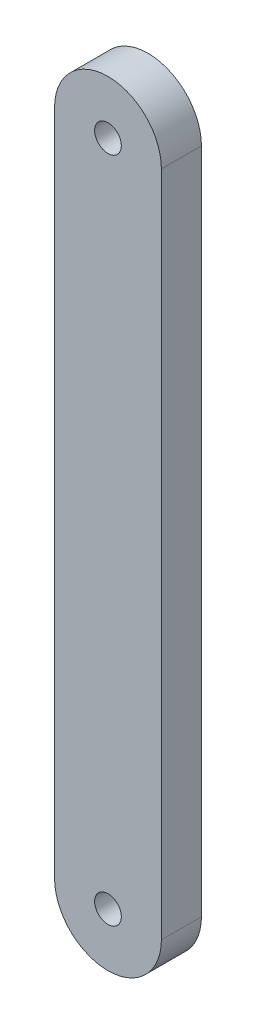
ISO-10303-21;
HEADER;
FILE_DESCRIPTION(('STEP AP214'),'2;1');
FILE_NAME('part.step','',(''),(''),'','','');
FILE_SCHEMA(('AUTOMOTIVE_DESIGN { 1 0 10303 214 1 1 1 1 }'));
ENDSEC;
DATA;
#1=APPLICATION_CONTEXT('core data for automotive mechanical design processes');
#2=APPLICATION_PROTOCOL_DEFINITION('international standard','automotive_design',2000,#1);
#3=PRODUCT_CONTEXT('',#1,'mechanical');
#4=PRODUCT('Part','Part','',(#3));
#5=PRODUCT_RELATED_PRODUCT_CATEGORY('part','',(#4));
#6=PRODUCT_DEFINITION_FORMATION('','',#4);
#7=PRODUCT_DEFINITION_CONTEXT('part definition',#1,'design');
#8=PRODUCT_DEFINITION('design','',#6,#7);
#9=PRODUCT_DEFINITION_SHAPE('','',#8);
#10=(LENGTH_UNIT() NAMED_UNIT(*) SI_UNIT(.MILLI.,.METRE.));
#11=(NAMED_UNIT(*) PLANE_ANGLE_UNIT() SI_UNIT($,.RADIAN.));
#12=(NAMED_UNIT(*) SI_UNIT($,.STERADIAN.) SOLID_ANGLE_UNIT());
#13=UNCERTAINTY_MEASURE_WITH_UNIT(LENGTH_MEASURE(1.E-05),#10,'distance_accuracy_value','');
#14=(GEOMETRIC_REPRESENTATION_CONTEXT(3) GLOBAL_UNCERTAINTY_ASSIGNED_CONTEXT((#13)) GLOBAL_UNIT_ASSIGNED_CONTEXT((#10,
#11,#12)) REPRESENTATION_CONTEXT('',''));
#15=CARTESIAN_POINT('',(0.,0.,0.));
#16=DIRECTION('',(0.,0.,1.));
#17=DIRECTION('',(1.,0.,0.));
#18=AXIS2_PLACEMENT_3D('',#15,#16,#17);
#19=CARTESIAN_POINT('',(38.7468759711318,62.5456089066798,3.));
#20=DIRECTION('',(0.,0.,1.));
#21=DIRECTION('',(1.,0.,0.));
#22=AXIS2_PLACEMENT_3D('',#19,#20,#21);
#23=PLANE('',#22);
#24=CARTESIAN_POINT('',(38.7468759711318,12.5456089066798,3.));
#25=DIRECTION('',(0.,0.,1.));
#26=DIRECTION('',(1.,0.,0.));
#27=AXIS2_PLACEMENT_3D('',#24,#25,#26);
#28=CIRCLE('',#27,1.);
#29=CARTESIAN_POINT('',(39.7468759711318,12.5456089066798,3.));
#30=VERTEX_POINT('',#29);
#31=EDGE_CURVE('E141',#30,#30,#28,.T.);
#32=ORIENTED_EDGE('',*,*,#31,.F.);
#33=EDGE_LOOP('',(#32));
#34=FACE_BOUND('',#33,.T.);
#35=CARTESIAN_POINT('',(38.7468759711318,62.5456089066798,3.));
#36=DIRECTION('',(0.,0.,1.));
#37=DIRECTION('',(1.,0.,0.));
#38=AXIS2_PLACEMENT_3D('',#35,#36,#37);
#39=CIRCLE('',#38,4.);
#40=CARTESIAN_POINT('',(42.7468759711318,62.5456089066798,3.));
#41=VERTEX_POINT('',#40);
#42=CARTESIAN_POINT('',(34.7468759711318,62.5456089066798,3.));
#43=VERTEX_POINT('',#42);
#44=EDGE_CURVE('E120',#41,#43,#39,.T.);
#45=ORIENTED_EDGE('',*,*,#44,.T.);
#46=DIRECTION('',(0.,-1.,0.));
#47=VECTOR('',#46,1.);
#48=CARTESIAN_POINT('',(34.7468759711318,62.5456089066798,3.));
#49=LINE('',#48,#47);
#50=CARTESIAN_POINT('',(34.7468759711318,12.5456089066798,3.));
#51=VERTEX_POINT('',#50);
#52=EDGE_CURVE('E113',#43,#51,#49,.T.);
#53=ORIENTED_EDGE('',*,*,#52,.T.);
#54=CARTESIAN_POINT('',(38.7468759711318,12.5456089066798,3.));
#55=DIRECTION('',(0.,0.,1.));
#56=DIRECTION('',(1.,0.,0.));
#57=AXIS2_PLACEMENT_3D('',#54,#55,#56);
#58=CIRCLE('',#57,4.);
#59=CARTESIAN_POINT('',(42.7468759711318,12.5456089066798,3.));
#60=VERTEX_POINT('',#59);
#61=EDGE_CURVE('E119',#51,#60,#58,.T.);
#62=ORIENTED_EDGE('',*,*,#61,.T.);
#63=DIRECTION('',(0.,-1.,0.));
#64=VECTOR('',#63,1.);
#65=CARTESIAN_POINT('',(42.7468759711318,62.5456089066798,3.));
#66=LINE('',#65,#64);
#67=EDGE_CURVE('E132',#41,#60,#66,.T.);
#68=ORIENTED_EDGE('',*,*,#67,.F.);
#69=EDGE_LOOP('',(#45,#53,#62,#68));
#70=FACE_BOUND('',#69,.T.);
#71=CARTESIAN_POINT('',(38.7468759711318,62.5456089066798,3.));
#72=DIRECTION('',(0.,0.,1.));
#73=DIRECTION('',(1.,0.,0.));
#74=AXIS2_PLACEMENT_3D('',#71,#72,#73);
#75=CIRCLE('',#74,1.);
#76=CARTESIAN_POINT('',(39.7468759711318,62.5456089066798,3.));
#77=VERTEX_POINT('',#76);
#78=EDGE_CURVE('E161',#77,#77,#75,.T.);
#79=ORIENTED_EDGE('',*,*,#78,.F.);
#80=EDGE_LOOP('',(#79));
#81=FACE_BOUND('',#80,.T.);
#82=ADVANCED_FACE('F69',(#34,#70,#81),#23,.T.);
#83=CARTESIAN_POINT('',(38.7468759711318,62.5456089066798,0.));
#84=DIRECTION('',(0.,0.,1.));
#85=DIRECTION('',(1.,0.,0.));
#86=AXIS2_PLACEMENT_3D('',#83,#84,#85);
#87=PLANE('',#86);
#88=CARTESIAN_POINT('',(38.7468759711318,62.5456089066798,0.));
#89=DIRECTION('',(0.,0.,1.));
#90=DIRECTION('',(1.,0.,0.));
#91=AXIS2_PLACEMENT_3D('',#88,#89,#90);
#92=CIRCLE('',#91,4.);
#93=CARTESIAN_POINT('',(42.7468759711318,62.5456089066798,0.));
#94=VERTEX_POINT('',#93);
#95=CARTESIAN_POINT('',(34.7468759711318,62.5456089066798,0.));
#96=VERTEX_POINT('',#95);
#97=EDGE_CURVE('E138',#94,#96,#92,.T.);
#98=ORIENTED_EDGE('',*,*,#97,.F.);
#99=DIRECTION('',(0.,-1.,0.));
#100=VECTOR('',#99,1.);
#101=CARTESIAN_POINT('',(42.7468759711318,62.5456089066798,0.));
#102=LINE('',#101,#100);
#103=CARTESIAN_POINT('',(42.7468759711318,12.5456089066798,0.));
#104=VERTEX_POINT('',#103);
#105=EDGE_CURVE('E147',#94,#104,#102,.T.);
#106=ORIENTED_EDGE('',*,*,#105,.T.);
#107=CARTESIAN_POINT('',(38.7468759711318,12.5456089066798,0.));
#108=DIRECTION('',(0.,0.,1.));
#109=DIRECTION('',(1.,0.,0.));
#110=AXIS2_PLACEMENT_3D('',#107,#108,#109);
#111=CIRCLE('',#110,4.);
#112=CARTESIAN_POINT('',(34.7468759711318,12.5456089066798,0.));
#113=VERTEX_POINT('',#112);
#114=EDGE_CURVE('E144',#113,#104,#111,.T.);
#115=ORIENTED_EDGE('',*,*,#114,.F.);
#116=DIRECTION('',(0.,-1.,0.));
#117=VECTOR('',#116,1.);
#118=CARTESIAN_POINT('',(34.7468759711318,62.5456089066798,0.));
#119=LINE('',#118,#117);
#120=EDGE_CURVE('E126',#96,#113,#119,.T.);
#121=ORIENTED_EDGE('',*,*,#120,.F.);
#122=EDGE_LOOP('',(#98,#106,#115,#121));
#123=FACE_BOUND('',#122,.T.);
#124=CARTESIAN_POINT('',(38.7468759711318,12.5456089066798,0.));
#125=DIRECTION('',(0.,0.,1.));
#126=DIRECTION('',(1.,0.,0.));
#127=AXIS2_PLACEMENT_3D('',#124,#125,#126);
#128=CIRCLE('',#127,1.);
#129=CARTESIAN_POINT('',(39.7468759711318,12.5456089066798,0.));
#130=VERTEX_POINT('',#129);
#131=EDGE_CURVE('E157',#130,#130,#128,.T.);
#132=ORIENTED_EDGE('',*,*,#131,.T.);
#133=EDGE_LOOP('',(#132));
#134=FACE_BOUND('',#133,.T.);
#135=CARTESIAN_POINT('',(38.7468759711318,62.5456089066798,0.));
#136=DIRECTION('',(0.,0.,1.));
#137=DIRECTION('',(1.,0.,0.));
#138=AXIS2_PLACEMENT_3D('',#135,#136,#137);
#139=CIRCLE('',#138,1.);
#140=CARTESIAN_POINT('',(39.7468759711318,62.5456089066798,0.));
#141=VERTEX_POINT('',#140);
#142=EDGE_CURVE('E165',#141,#141,#139,.T.);
#143=ORIENTED_EDGE('',*,*,#142,.T.);
#144=EDGE_LOOP('',(#143));
#145=FACE_BOUND('',#144,.T.);
#146=ADVANCED_FACE('F176',(#123,#134,#145),#87,.F.);
#147=CARTESIAN_POINT('',(38.7468759711318,62.5456089066798,3.));
#148=DIRECTION('',(0.,0.,-1.));
#149=DIRECTION('',(-1.,0.,0.));
#150=AXIS2_PLACEMENT_3D('',#147,#148,#149);
#151=CYLINDRICAL_SURFACE('',#150,4.);
#152=ORIENTED_EDGE('',*,*,#97,.T.);
#153=DIRECTION('',(0.,0.,-1.));
#154=VECTOR('',#153,1.);
#155=CARTESIAN_POINT('',(34.7468759711318,62.5456089066798,3.));
#156=LINE('',#155,#154);
#157=EDGE_CURVE('E12',#43,#96,#156,.T.);
#158=ORIENTED_EDGE('',*,*,#157,.F.);
#159=ORIENTED_EDGE('',*,*,#44,.F.);
#160=DIRECTION('',(0.,0.,-1.));
#161=VECTOR('',#160,1.);
#162=CARTESIAN_POINT('',(42.7468759711318,62.5456089066798,3.));
#163=LINE('',#162,#161);
#164=EDGE_CURVE('E87',#41,#94,#163,.T.);
#165=ORIENTED_EDGE('',*,*,#164,.T.);
#166=EDGE_LOOP('',(#152,#158,#159,#165));
#167=FACE_BOUND('',#166,.T.);
#168=ADVANCED_FACE('F71',(#167),#151,.T.);
#169=CARTESIAN_POINT('',(34.7468759711318,62.5456089066798,3.));
#170=DIRECTION('',(1.,0.,0.));
#171=DIRECTION('',(0.,0.,-1.));
#172=AXIS2_PLACEMENT_3D('',#169,#170,#171);
#173=PLANE('',#172);
#174=ORIENTED_EDGE('',*,*,#120,.T.);
#175=DIRECTION('',(0.,0.,-1.));
#176=VECTOR('',#175,1.);
#177=CARTESIAN_POINT('',(34.7468759711318,12.5456089066798,3.));
#178=LINE('',#177,#176);
#179=EDGE_CURVE('E79',#51,#113,#178,.T.);
#180=ORIENTED_EDGE('',*,*,#179,.F.);
#181=ORIENTED_EDGE('',*,*,#52,.F.);
#182=ORIENTED_EDGE('',*,*,#157,.T.);
#183=EDGE_LOOP('',(#174,#180,#181,#182));
#184=FACE_BOUND('',#183,.T.);
#185=ADVANCED_FACE('F125',(#184),#173,.F.);
#186=CARTESIAN_POINT('',(38.7468759711318,12.5456089066798,3.));
#187=DIRECTION('',(0.,0.,-1.));
#188=DIRECTION('',(-1.,0.,0.));
#189=AXIS2_PLACEMENT_3D('',#186,#187,#188);
#190=CYLINDRICAL_SURFACE('',#189,4.);
#191=ORIENTED_EDGE('',*,*,#114,.T.);
#192=DIRECTION('',(0.,0.,-1.));
#193=VECTOR('',#192,1.);
#194=CARTESIAN_POINT('',(42.7468759711318,12.5456089066798,3.));
#195=LINE('',#194,#193);
#196=EDGE_CURVE('E102',#60,#104,#195,.T.);
#197=ORIENTED_EDGE('',*,*,#196,.F.);
#198=ORIENTED_EDGE('',*,*,#61,.F.);
#199=ORIENTED_EDGE('',*,*,#179,.T.);
#200=EDGE_LOOP('',(#191,#197,#198,#199));
#201=FACE_BOUND('',#200,.T.);
#202=ADVANCED_FACE('F130',(#201),#190,.T.);
#203=CARTESIAN_POINT('',(42.7468759711318,62.5456089066798,3.));
#204=DIRECTION('',(1.,0.,0.));
#205=DIRECTION('',(0.,0.,-1.));
#206=AXIS2_PLACEMENT_3D('',#203,#204,#205);
#207=PLANE('',#206);
#208=ORIENTED_EDGE('',*,*,#105,.F.);
#209=ORIENTED_EDGE('',*,*,#164,.F.);
#210=ORIENTED_EDGE('',*,*,#67,.T.);
#211=ORIENTED_EDGE('',*,*,#196,.T.);
#212=EDGE_LOOP('',(#208,#209,#210,#211));
#213=FACE_BOUND('',#212,.T.);
#214=ADVANCED_FACE('F188',(#213),#207,.T.);
#215=CARTESIAN_POINT('',(38.7468759711318,12.5456089066798,3.));
#216=DIRECTION('',(0.,0.,-1.));
#217=DIRECTION('',(-1.,0.,0.));
#218=AXIS2_PLACEMENT_3D('',#215,#216,#217);
#219=CYLINDRICAL_SURFACE('',#218,1.);
#220=ORIENTED_EDGE('',*,*,#31,.T.);
#221=EDGE_LOOP('',(#220));
#222=FACE_BOUND('',#221,.T.);
#223=ORIENTED_EDGE('',*,*,#131,.F.);
#224=EDGE_LOOP('',(#223));
#225=FACE_BOUND('',#224,.T.);
#226=ADVANCED_FACE('F185',(#222,#225),#219,.F.);
#227=CARTESIAN_POINT('',(38.7468759711318,62.5456089066798,3.));
#228=DIRECTION('',(0.,0.,-1.));
#229=DIRECTION('',(-1.,0.,0.));
#230=AXIS2_PLACEMENT_3D('',#227,#228,#229);
#231=CYLINDRICAL_SURFACE('',#230,1.);
#232=ORIENTED_EDGE('',*,*,#78,.T.);
#233=EDGE_LOOP('',(#232));
#234=FACE_BOUND('',#233,.T.);
#235=ORIENTED_EDGE('',*,*,#142,.F.);
#236=EDGE_LOOP('',(#235));
#237=FACE_BOUND('',#236,.T.);
#238=ADVANCED_FACE('F173',(#234,#237),#231,.F.);
#239=CLOSED_SHELL('',(#82,#146,#168,#185,#202,#214,#226,#238));
#240=MANIFOLD_SOLID_BREP('B2',#239);
#241=ADVANCED_BREP_SHAPE_REPRESENTATION('',(#18,#240),#14);
#242=SHAPE_DEFINITION_REPRESENTATION(#9,#241);
ENDSEC;
END-ISO-10303-21;
